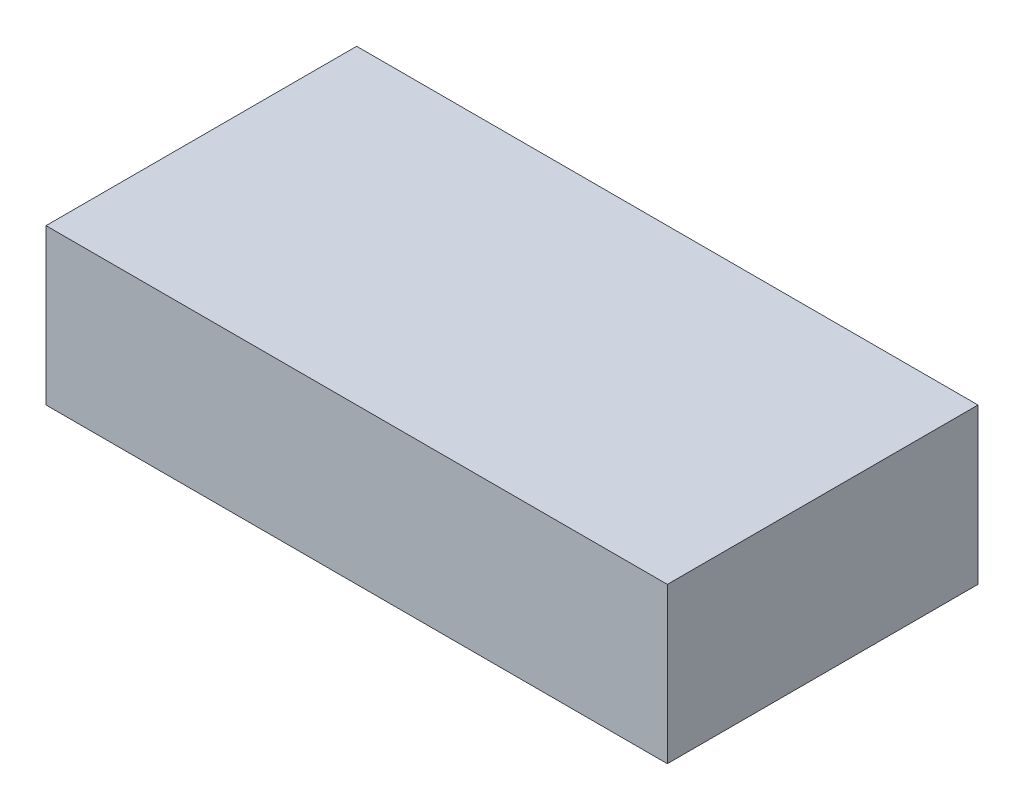
ISO-10303-21;
HEADER;
FILE_DESCRIPTION(('STEP AP214'),'2;1');
FILE_NAME('part.step','',(''),(''),'','','');
FILE_SCHEMA(('AUTOMOTIVE_DESIGN { 1 0 10303 214 1 1 1 1 }'));
ENDSEC;
DATA;
#1=APPLICATION_CONTEXT('core data for automotive mechanical design processes');
#2=APPLICATION_PROTOCOL_DEFINITION('international standard','automotive_design',2000,#1);
#3=PRODUCT_CONTEXT('',#1,'mechanical');
#4=PRODUCT('Part','Part','',(#3));
#5=PRODUCT_RELATED_PRODUCT_CATEGORY('part','',(#4));
#6=PRODUCT_DEFINITION_FORMATION('','',#4);
#7=PRODUCT_DEFINITION_CONTEXT('part definition',#1,'design');
#8=PRODUCT_DEFINITION('design','',#6,#7);
#9=PRODUCT_DEFINITION_SHAPE('','',#8);
#10=(LENGTH_UNIT() NAMED_UNIT(*) SI_UNIT(.MILLI.,.METRE.));
#11=(NAMED_UNIT(*) PLANE_ANGLE_UNIT() SI_UNIT($,.RADIAN.));
#12=(NAMED_UNIT(*) SI_UNIT($,.STERADIAN.) SOLID_ANGLE_UNIT());
#13=UNCERTAINTY_MEASURE_WITH_UNIT(LENGTH_MEASURE(1.E-05),#10,'distance_accuracy_value','');
#14=(GEOMETRIC_REPRESENTATION_CONTEXT(3) GLOBAL_UNCERTAINTY_ASSIGNED_CONTEXT((#13)) GLOBAL_UNIT_ASSIGNED_CONTEXT((#10,
#11,#12)) REPRESENTATION_CONTEXT('',''));
#15=CARTESIAN_POINT('',(0.,0.,0.));
#16=DIRECTION('',(0.,0.,1.));
#17=DIRECTION('',(1.,0.,0.));
#18=AXIS2_PLACEMENT_3D('',#15,#16,#17);
#19=CARTESIAN_POINT('',(0.,0.,0.));
#20=DIRECTION('',(0.,1.,0.));
#21=DIRECTION('',(0.,0.,1.));
#22=AXIS2_PLACEMENT_3D('',#19,#20,#21);
#23=PLANE('',#22);
#24=DIRECTION('',(0.,0.,-1.));
#25=VECTOR('',#24,1.);
#26=CARTESIAN_POINT('',(0.3,0.,0.));
#27=LINE('',#26,#25);
#28=CARTESIAN_POINT('',(0.3,0.,0.25));
#29=VERTEX_POINT('',#28);
#30=CARTESIAN_POINT('',(0.3,0.,-0.25));
#31=VERTEX_POINT('',#30);
#32=EDGE_CURVE('E11',#29,#31,#27,.T.);
#33=ORIENTED_EDGE('',*,*,#32,.F.);
#34=DIRECTION('',(1.,0.,0.));
#35=VECTOR('',#34,1.);
#36=CARTESIAN_POINT('',(0.5,0.,0.25));
#37=LINE('',#36,#35);
#38=CARTESIAN_POINT('',(-0.3,0.,0.25));
#39=VERTEX_POINT('',#38);
#40=EDGE_CURVE('E153',#39,#29,#37,.T.);
#41=ORIENTED_EDGE('',*,*,#40,.F.);
#42=DIRECTION('',(0.,0.,1.));
#43=VECTOR('',#42,1.);
#44=CARTESIAN_POINT('',(-0.3,0.,0.));
#45=LINE('',#44,#43);
#46=CARTESIAN_POINT('',(-0.3,0.,0.05));
#47=VERTEX_POINT('',#46);
#48=EDGE_CURVE('E124',#47,#39,#45,.T.);
#49=ORIENTED_EDGE('',*,*,#48,.F.);
#50=DIRECTION('',(-1.,0.,0.));
#51=VECTOR('',#50,1.);
#52=CARTESIAN_POINT('',(0.,0.,0.0500000000000001));
#53=LINE('',#52,#51);
#54=CARTESIAN_POINT('',(-0.2,0.,0.05));
#55=VERTEX_POINT('',#54);
#56=EDGE_CURVE('E127',#55,#47,#53,.T.);
#57=ORIENTED_EDGE('',*,*,#56,.F.);
#58=DIRECTION('',(0.,0.,1.));
#59=VECTOR('',#58,1.);
#60=CARTESIAN_POINT('',(-0.2,0.,0.));
#61=LINE('',#60,#59);
#62=CARTESIAN_POINT('',(-0.2,0.,-0.05));
#63=VERTEX_POINT('',#62);
#64=EDGE_CURVE('E135',#63,#55,#61,.T.);
#65=ORIENTED_EDGE('',*,*,#64,.F.);
#66=DIRECTION('',(1.,0.,0.));
#67=VECTOR('',#66,1.);
#68=CARTESIAN_POINT('',(0.,0.,-0.05));
#69=LINE('',#68,#67);
#70=CARTESIAN_POINT('',(-0.3,0.,-0.05));
#71=VERTEX_POINT('',#70);
#72=EDGE_CURVE('E138',#71,#63,#69,.T.);
#73=ORIENTED_EDGE('',*,*,#72,.F.);
#74=DIRECTION('',(0.,0.,1.));
#75=VECTOR('',#74,1.);
#76=CARTESIAN_POINT('',(-0.3,0.,0.));
#77=LINE('',#76,#75);
#78=CARTESIAN_POINT('',(-0.3,0.,-0.25));
#79=VERTEX_POINT('',#78);
#80=EDGE_CURVE('E45',#79,#71,#77,.T.);
#81=ORIENTED_EDGE('',*,*,#80,.F.);
#82=DIRECTION('',(-1.,0.,0.));
#83=VECTOR('',#82,1.);
#84=CARTESIAN_POINT('',(0.5,0.,-0.25));
#85=LINE('',#84,#83);
#86=EDGE_CURVE('E173',#31,#79,#85,.T.);
#87=ORIENTED_EDGE('',*,*,#86,.F.);
#88=EDGE_LOOP('',(#33,#41,#49,#57,#65,#73,#81,#87));
#89=FACE_BOUND('',#88,.T.);
#90=ADVANCED_FACE('F36',(#89),#23,.F.);
#91=CARTESIAN_POINT('',(0.5,0.,0.25));
#92=VERTEX_POINT('',#91);
#93=EDGE_CURVE('E155',#29,#92,#37,.T.);
#94=ORIENTED_EDGE('',*,*,#93,.F.);
#95=ORIENTED_EDGE('',*,*,#32,.T.);
#96=CARTESIAN_POINT('',(0.5,0.,-0.25));
#97=VERTEX_POINT('',#96);
#98=EDGE_CURVE('E120',#97,#31,#85,.T.);
#99=ORIENTED_EDGE('',*,*,#98,.F.);
#100=DIRECTION('',(0.,0.,-1.));
#101=VECTOR('',#100,1.);
#102=CARTESIAN_POINT('',(0.5,0.,0.25));
#103=LINE('',#102,#101);
#104=EDGE_CURVE('E157',#92,#97,#103,.T.);
#105=ORIENTED_EDGE('',*,*,#104,.F.);
#106=EDGE_LOOP('',(#94,#95,#99,#105));
#107=FACE_BOUND('',#106,.T.);
#108=ADVANCED_FACE('F174',(#107),#23,.F.);
#109=CARTESIAN_POINT('',(-0.5,0.25,0.25));
#110=DIRECTION('',(1.,0.,0.));
#111=DIRECTION('',(0.,0.,-1.));
#112=AXIS2_PLACEMENT_3D('',#109,#110,#111);
#113=PLANE('',#112);
#114=DIRECTION('',(0.,0.,1.));
#115=VECTOR('',#114,1.);
#116=CARTESIAN_POINT('',(-0.5,0.,0.25));
#117=LINE('',#116,#115);
#118=CARTESIAN_POINT('',(-0.5,0.,-0.25));
#119=VERTEX_POINT('',#118);
#120=CARTESIAN_POINT('',(-0.5,0.,0.25));
#121=VERTEX_POINT('',#120);
#122=EDGE_CURVE('E123',#119,#121,#117,.T.);
#123=ORIENTED_EDGE('',*,*,#122,.T.);
#124=DIRECTION('',(0.,-1.,0.));
#125=VECTOR('',#124,1.);
#126=CARTESIAN_POINT('',(-0.5,0.25,0.25));
#127=LINE('',#126,#125);
#128=CARTESIAN_POINT('',(-0.5,0.25,0.25));
#129=VERTEX_POINT('',#128);
#130=EDGE_CURVE('E104',#129,#121,#127,.T.);
#131=ORIENTED_EDGE('',*,*,#130,.F.);
#132=DIRECTION('',(0.,0.,1.));
#133=VECTOR('',#132,1.);
#134=CARTESIAN_POINT('',(-0.5,0.25,0.25));
#135=LINE('',#134,#133);
#136=CARTESIAN_POINT('',(-0.5,0.25,-0.25));
#137=VERTEX_POINT('',#136);
#138=EDGE_CURVE('E111',#137,#129,#135,.T.);
#139=ORIENTED_EDGE('',*,*,#138,.F.);
#140=DIRECTION('',(0.,-1.,0.));
#141=VECTOR('',#140,1.);
#142=CARTESIAN_POINT('',(-0.5,0.25,-0.25));
#143=LINE('',#142,#141);
#144=EDGE_CURVE('E162',#137,#119,#143,.T.);
#145=ORIENTED_EDGE('',*,*,#144,.T.);
#146=EDGE_LOOP('',(#123,#131,#139,#145));
#147=FACE_BOUND('',#146,.T.);
#148=ADVANCED_FACE('F38',(#147),#113,.F.);
#149=CARTESIAN_POINT('',(0.5,0.25,0.25));
#150=DIRECTION('',(0.,0.,-1.));
#151=DIRECTION('',(-1.,0.,0.));
#152=AXIS2_PLACEMENT_3D('',#149,#150,#151);
#153=PLANE('',#152);
#154=EDGE_CURVE('E154',#121,#39,#37,.T.);
#155=ORIENTED_EDGE('',*,*,#154,.T.);
#156=ORIENTED_EDGE('',*,*,#40,.T.);
#157=ORIENTED_EDGE('',*,*,#93,.T.);
#158=DIRECTION('',(0.,-1.,0.));
#159=VECTOR('',#158,1.);
#160=CARTESIAN_POINT('',(0.5,0.25,0.25));
#161=LINE('',#160,#159);
#162=CARTESIAN_POINT('',(0.5,0.25,0.25));
#163=VERTEX_POINT('',#162);
#164=EDGE_CURVE('E107',#163,#92,#161,.T.);
#165=ORIENTED_EDGE('',*,*,#164,.F.);
#166=DIRECTION('',(1.,0.,0.));
#167=VECTOR('',#166,1.);
#168=CARTESIAN_POINT('',(0.5,0.25,0.25));
#169=LINE('',#168,#167);
#170=EDGE_CURVE('E99',#129,#163,#169,.T.);
#171=ORIENTED_EDGE('',*,*,#170,.F.);
#172=ORIENTED_EDGE('',*,*,#130,.T.);
#173=EDGE_LOOP('',(#155,#156,#157,#165,#171,#172));
#174=FACE_BOUND('',#173,.T.);
#175=ADVANCED_FACE('F102',(#174),#153,.F.);
#176=CARTESIAN_POINT('',(0.5,0.25,0.25));
#177=DIRECTION('',(-1.,0.,0.));
#178=DIRECTION('',(0.,0.,1.));
#179=AXIS2_PLACEMENT_3D('',#176,#177,#178);
#180=PLANE('',#179);
#181=ORIENTED_EDGE('',*,*,#104,.T.);
#182=DIRECTION('',(0.,-1.,0.));
#183=VECTOR('',#182,1.);
#184=CARTESIAN_POINT('',(0.5,0.25,-0.25));
#185=LINE('',#184,#183);
#186=CARTESIAN_POINT('',(0.5,0.25,-0.25));
#187=VERTEX_POINT('',#186);
#188=EDGE_CURVE('E129',#187,#97,#185,.T.);
#189=ORIENTED_EDGE('',*,*,#188,.F.);
#190=DIRECTION('',(0.,0.,-1.));
#191=VECTOR('',#190,1.);
#192=CARTESIAN_POINT('',(0.5,0.25,0.25));
#193=LINE('',#192,#191);
#194=EDGE_CURVE('E110',#163,#187,#193,.T.);
#195=ORIENTED_EDGE('',*,*,#194,.F.);
#196=ORIENTED_EDGE('',*,*,#164,.T.);
#197=EDGE_LOOP('',(#181,#189,#195,#196));
#198=FACE_BOUND('',#197,.T.);
#199=ADVANCED_FACE('F166',(#198),#180,.F.);
#200=CARTESIAN_POINT('',(0.5,0.25,-0.25));
#201=DIRECTION('',(0.,0.,1.));
#202=DIRECTION('',(1.,0.,0.));
#203=AXIS2_PLACEMENT_3D('',#200,#201,#202);
#204=PLANE('',#203);
#205=ORIENTED_EDGE('',*,*,#98,.T.);
#206=ORIENTED_EDGE('',*,*,#86,.T.);
#207=EDGE_CURVE('E149',#79,#119,#85,.T.);
#208=ORIENTED_EDGE('',*,*,#207,.T.);
#209=ORIENTED_EDGE('',*,*,#144,.F.);
#210=DIRECTION('',(-1.,0.,0.));
#211=VECTOR('',#210,1.);
#212=CARTESIAN_POINT('',(0.5,0.25,-0.25));
#213=LINE('',#212,#211);
#214=EDGE_CURVE('E116',#187,#137,#213,.T.);
#215=ORIENTED_EDGE('',*,*,#214,.F.);
#216=ORIENTED_EDGE('',*,*,#188,.T.);
#217=EDGE_LOOP('',(#205,#206,#208,#209,#215,#216));
#218=FACE_BOUND('',#217,.T.);
#219=ADVANCED_FACE('F170',(#218),#204,.F.);
#220=CARTESIAN_POINT('',(0.,0.25,0.));
#221=DIRECTION('',(0.,1.,0.));
#222=DIRECTION('',(0.,0.,1.));
#223=AXIS2_PLACEMENT_3D('',#220,#221,#222);
#224=PLANE('',#223);
#225=ORIENTED_EDGE('',*,*,#138,.T.);
#226=ORIENTED_EDGE('',*,*,#170,.T.);
#227=ORIENTED_EDGE('',*,*,#194,.T.);
#228=ORIENTED_EDGE('',*,*,#214,.T.);
#229=EDGE_LOOP('',(#225,#226,#227,#228));
#230=FACE_BOUND('',#229,.T.);
#231=ADVANCED_FACE('F114',(#230),#224,.T.);
#232=ORIENTED_EDGE('',*,*,#207,.F.);
#233=ORIENTED_EDGE('',*,*,#80,.T.);
#234=ORIENTED_EDGE('',*,*,#72,.T.);
#235=ORIENTED_EDGE('',*,*,#64,.T.);
#236=ORIENTED_EDGE('',*,*,#56,.T.);
#237=ORIENTED_EDGE('',*,*,#48,.T.);
#238=ORIENTED_EDGE('',*,*,#154,.F.);
#239=ORIENTED_EDGE('',*,*,#122,.F.);
#240=EDGE_LOOP('',(#232,#233,#234,#235,#236,#237,#238,#239));
#241=FACE_BOUND('',#240,.T.);
#242=ADVANCED_FACE('F147',(#241),#23,.F.);
#243=CLOSED_SHELL('',(#90,#108,#148,#175,#199,#219,#231,#242));
#244=MANIFOLD_SOLID_BREP('B2',#243);
#245=ADVANCED_BREP_SHAPE_REPRESENTATION('',(#18,#244),#14);
#246=SHAPE_DEFINITION_REPRESENTATION(#9,#245);
ENDSEC;
END-ISO-10303-21;
